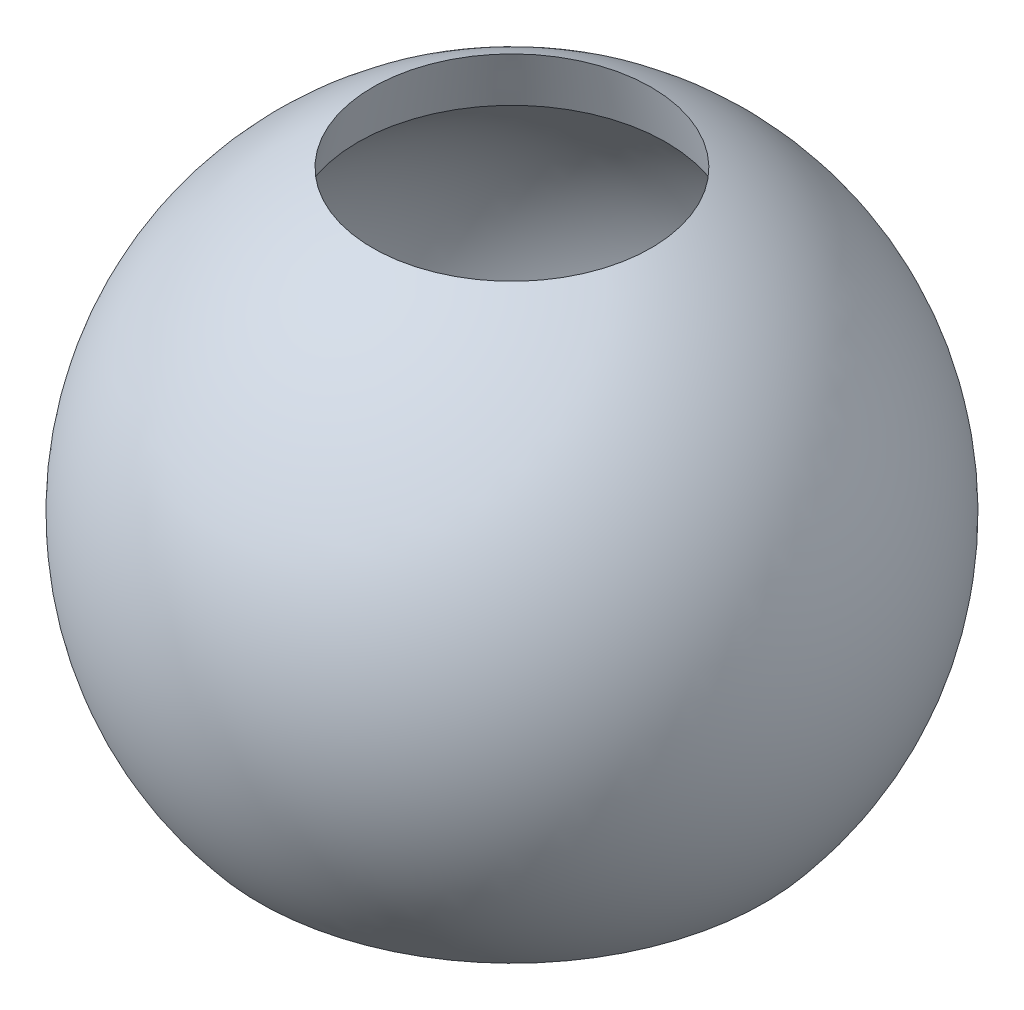
ISO-10303-21;
HEADER;
FILE_DESCRIPTION(('STEP AP214'),'2;1');
FILE_NAME('part.step','',(''),(''),'','','');
FILE_SCHEMA(('AUTOMOTIVE_DESIGN { 1 0 10303 214 1 1 1 1 }'));
ENDSEC;
DATA;
#1=APPLICATION_CONTEXT('core data for automotive mechanical design processes');
#2=APPLICATION_PROTOCOL_DEFINITION('international standard','automotive_design',2000,#1);
#3=PRODUCT_CONTEXT('',#1,'mechanical');
#4=PRODUCT('Part','Part','',(#3));
#5=PRODUCT_RELATED_PRODUCT_CATEGORY('part','',(#4));
#6=PRODUCT_DEFINITION_FORMATION('','',#4);
#7=PRODUCT_DEFINITION_CONTEXT('part definition',#1,'design');
#8=PRODUCT_DEFINITION('design','',#6,#7);
#9=PRODUCT_DEFINITION_SHAPE('','',#8);
#10=(LENGTH_UNIT() NAMED_UNIT(*) SI_UNIT(.MILLI.,.METRE.));
#11=(NAMED_UNIT(*) PLANE_ANGLE_UNIT() SI_UNIT($,.RADIAN.));
#12=(NAMED_UNIT(*) SI_UNIT($,.STERADIAN.) SOLID_ANGLE_UNIT());
#13=UNCERTAINTY_MEASURE_WITH_UNIT(LENGTH_MEASURE(1.E-05),#10,'distance_accuracy_value','');
#14=(GEOMETRIC_REPRESENTATION_CONTEXT(3) GLOBAL_UNCERTAINTY_ASSIGNED_CONTEXT((#13)) GLOBAL_UNIT_ASSIGNED_CONTEXT((#10,
#11,#12)) REPRESENTATION_CONTEXT('',''));
#15=CARTESIAN_POINT('',(0.,0.,0.));
#16=DIRECTION('',(0.,0.,1.));
#17=DIRECTION('',(1.,0.,0.));
#18=AXIS2_PLACEMENT_3D('',#15,#16,#17);
#19=CARTESIAN_POINT('',(0.,0.,0.));
#20=DIRECTION('',(0.,-1.,0.));
#21=DIRECTION('',(0.,0.,1.));
#22=AXIS2_PLACEMENT_3D('',#19,#20,#21);
#23=SPHERICAL_SURFACE('',#22,10.4985686621683);
#24=CARTESIAN_POINT('',(0.,8.87569344443978,0.));
#25=DIRECTION('',(0.,-1.,0.));
#26=DIRECTION('',(0.,0.,-1.));
#27=AXIS2_PLACEMENT_3D('',#24,#25,#26);
#28=CIRCLE('',#27,5.60731752575068);
#29=CARTESIAN_POINT('',(0.,8.87569344443978,-5.60731752575068));
#30=VERTEX_POINT('',#29);
#31=EDGE_CURVE('E10',#30,#30,#28,.T.);
#32=ORIENTED_EDGE('',*,*,#31,.F.);
#33=EDGE_LOOP('',(#32));
#34=FACE_BOUND('',#33,.T.);
#35=CARTESIAN_POINT('',(0.,-7.71345131623849,0.));
#36=DIRECTION('',(0.,-1.,0.));
#37=DIRECTION('',(0.,0.,-1.));
#38=AXIS2_PLACEMENT_3D('',#35,#36,#37);
#39=CIRCLE('',#38,7.12198095660756);
#40=CARTESIAN_POINT('',(0.,-7.71345131623849,-7.12198095660756));
#41=VERTEX_POINT('',#40);
#42=EDGE_CURVE('E50',#41,#41,#39,.T.);
#43=ORIENTED_EDGE('',*,*,#42,.T.);
#44=EDGE_LOOP('',(#43));
#45=FACE_BOUND('',#44,.T.);
#46=ADVANCED_FACE('F36',(#34,#45),#23,.F.);
#47=CARTESIAN_POINT('',(0.,8.87569344443978,0.));
#48=DIRECTION('',(0.,-1.,0.));
#49=DIRECTION('',(0.,0.,-1.));
#50=AXIS2_PLACEMENT_3D('',#47,#48,#49);
#51=CONICAL_SURFACE('',#50,5.60731752575068,0.261799387799145);
#52=CARTESIAN_POINT('',(0.,10.8756934444398,0.));
#53=DIRECTION('',(0.,-1.,0.));
#54=DIRECTION('',(0.,0.,-1.));
#55=AXIS2_PLACEMENT_3D('',#52,#53,#54);
#56=CIRCLE('',#55,5.07141914088845);
#57=CARTESIAN_POINT('',(0.,10.8756934444398,-5.07141914088845));
#58=VERTEX_POINT('',#57);
#59=EDGE_CURVE('E42',#58,#58,#56,.T.);
#60=ORIENTED_EDGE('',*,*,#59,.F.);
#61=EDGE_LOOP('',(#60));
#62=FACE_BOUND('',#61,.T.);
#63=ORIENTED_EDGE('',*,*,#31,.T.);
#64=EDGE_LOOP('',(#63));
#65=FACE_BOUND('',#64,.T.);
#66=ADVANCED_FACE('F65',(#62,#65),#51,.F.);
#67=CARTESIAN_POINT('',(0.,0.,0.));
#68=DIRECTION('',(0.,-1.,0.));
#69=DIRECTION('',(0.,0.,1.));
#70=AXIS2_PLACEMENT_3D('',#67,#68,#69);
#71=SPHERICAL_SURFACE('',#70,12.);
#72=CARTESIAN_POINT('',(0.,-7.71345131623849,0.));
#73=DIRECTION('',(0.,-1.,0.));
#74=DIRECTION('',(0.,0.,-1.));
#75=AXIS2_PLACEMENT_3D('',#72,#73,#74);
#76=CIRCLE('',#75,9.19253331742772);
#77=CARTESIAN_POINT('',(0.,-7.71345131623849,-9.19253331742772));
#78=VERTEX_POINT('',#77);
#79=EDGE_CURVE('E46',#78,#78,#76,.T.);
#80=ORIENTED_EDGE('',*,*,#79,.F.);
#81=EDGE_LOOP('',(#80));
#82=FACE_BOUND('',#81,.T.);
#83=ORIENTED_EDGE('',*,*,#59,.T.);
#84=EDGE_LOOP('',(#83));
#85=FACE_BOUND('',#84,.T.);
#86=ADVANCED_FACE('F60',(#82,#85),#71,.T.);
#87=CARTESIAN_POINT('',(0.,-7.71345131623849,7.12198095660756));
#88=DIRECTION('',(0.,1.,0.));
#89=DIRECTION('',(0.,0.,1.));
#90=AXIS2_PLACEMENT_3D('',#87,#88,#89);
#91=PLANE('',#90);
#92=ORIENTED_EDGE('',*,*,#42,.F.);
#93=EDGE_LOOP('',(#92));
#94=FACE_BOUND('',#93,.T.);
#95=ORIENTED_EDGE('',*,*,#79,.T.);
#96=EDGE_LOOP('',(#95));
#97=FACE_BOUND('',#96,.T.);
#98=ADVANCED_FACE('F57',(#94,#97),#91,.F.);
#99=CLOSED_SHELL('',(#46,#66,#86,#98));
#100=MANIFOLD_SOLID_BREP('B2',#99);
#101=ADVANCED_BREP_SHAPE_REPRESENTATION('',(#18,#100),#14);
#102=SHAPE_DEFINITION_REPRESENTATION(#9,#101);
ENDSEC;
END-ISO-10303-21;
